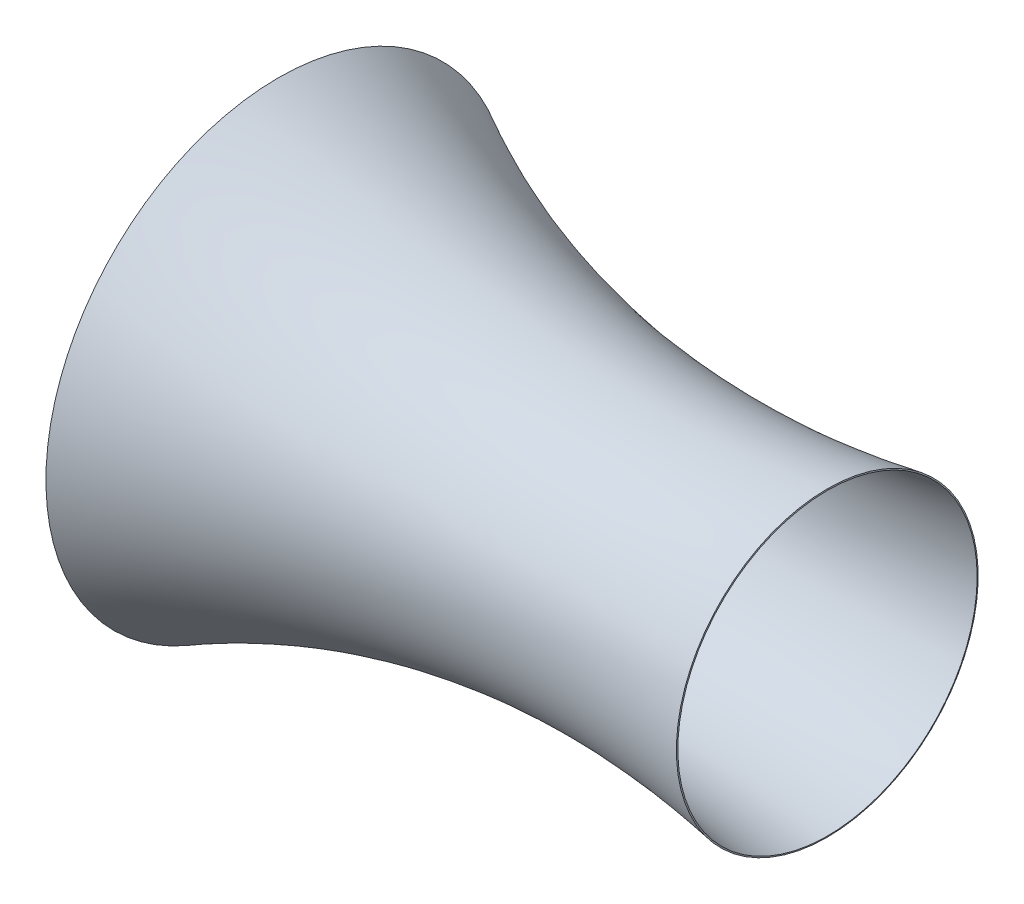
ISO-10303-21;
HEADER;
FILE_DESCRIPTION(('STEP AP214'),'2;1');
FILE_NAME('part.step','',(''),(''),'','','');
FILE_SCHEMA(('AUTOMOTIVE_DESIGN { 1 0 10303 214 1 1 1 1 }'));
ENDSEC;
DATA;
#1=APPLICATION_CONTEXT('core data for automotive mechanical design processes');
#2=APPLICATION_PROTOCOL_DEFINITION('international standard','automotive_design',2000,#1);
#3=PRODUCT_CONTEXT('',#1,'mechanical');
#4=PRODUCT('Part','Part','',(#3));
#5=PRODUCT_RELATED_PRODUCT_CATEGORY('part','',(#4));
#6=PRODUCT_DEFINITION_FORMATION('','',#4);
#7=PRODUCT_DEFINITION_CONTEXT('part definition',#1,'design');
#8=PRODUCT_DEFINITION('design','',#6,#7);
#9=PRODUCT_DEFINITION_SHAPE('','',#8);
#10=(LENGTH_UNIT() NAMED_UNIT(*) SI_UNIT(.MILLI.,.METRE.));
#11=(NAMED_UNIT(*) PLANE_ANGLE_UNIT() SI_UNIT($,.RADIAN.));
#12=(NAMED_UNIT(*) SI_UNIT($,.STERADIAN.) SOLID_ANGLE_UNIT());
#13=UNCERTAINTY_MEASURE_WITH_UNIT(LENGTH_MEASURE(1.E-05),#10,'distance_accuracy_value','');
#14=(GEOMETRIC_REPRESENTATION_CONTEXT(3) GLOBAL_UNCERTAINTY_ASSIGNED_CONTEXT((#13)) GLOBAL_UNIT_ASSIGNED_CONTEXT((#10,
#11,#12)) REPRESENTATION_CONTEXT('',''));
#15=CARTESIAN_POINT('',(0.,0.,0.));
#16=DIRECTION('',(0.,0.,1.));
#17=DIRECTION('',(1.,0.,0.));
#18=AXIS2_PLACEMENT_3D('',#15,#16,#17);
#19=CARTESIAN_POINT('',(58.1645223558109,0.,0.));
#20=DIRECTION('',(-1.,0.,0.));
#21=DIRECTION('',(0.,0.,1.));
#22=AXIS2_PLACEMENT_3D('',#19,#20,#21);
#23=PLANE('',#22);
#24=CARTESIAN_POINT('',(58.1645223558109,0.,0.));
#25=DIRECTION('',(1.,0.,0.));
#26=DIRECTION('',(0.,0.,-1.));
#27=AXIS2_PLACEMENT_3D('',#24,#25,#26);
#28=CIRCLE('',#27,825.);
#29=CARTESIAN_POINT('',(58.1645223558109,0.,-825.));
#30=VERTEX_POINT('',#29);
#31=EDGE_CURVE('E51',#30,#30,#28,.T.);
#32=ORIENTED_EDGE('',*,*,#31,.F.);
#33=EDGE_LOOP('',(#32));
#34=FACE_BOUND('',#33,.T.);
#35=CARTESIAN_POINT('',(58.1645223558109,0.,0.));
#36=DIRECTION('',(1.,0.,0.));
#37=DIRECTION('',(0.,0.,-1.));
#38=AXIS2_PLACEMENT_3D('',#35,#36,#37);
#39=CIRCLE('',#38,830.);
#40=CARTESIAN_POINT('',(58.1645223558109,0.,-830.));
#41=VERTEX_POINT('',#40);
#42=EDGE_CURVE('E114',#41,#41,#39,.T.);
#43=ORIENTED_EDGE('',*,*,#42,.T.);
#44=EDGE_LOOP('',(#43));
#45=FACE_BOUND('',#44,.T.);
#46=ADVANCED_FACE('F33',(#34,#45),#23,.F.);
#47=CARTESIAN_POINT('',(2200.,0.,0.));
#48=DIRECTION('',(-1.,0.,0.));
#49=DIRECTION('',(0.,0.,1.));
#50=AXIS2_PLACEMENT_3D('',#47,#48,#49);
#51=CONICAL_SURFACE('',#50,600.,1.39639197111225);
#52=CARTESIAN_POINT('',(2199.13239220012,0.,0.));
#53=DIRECTION('',(1.,0.,0.));
#54=DIRECTION('',(0.,1.,0.));
#55=AXIS2_PLACEMENT_3D('',#52,#53,#54);
#56=CIRCLE('',#55,604.924150353675);
#57=CARTESIAN_POINT('',(2199.13239220012,604.924150353675,0.));
#58=VERTEX_POINT('',#57);
#59=EDGE_CURVE('E10',#58,#58,#56,.T.);
#60=ORIENTED_EDGE('',*,*,#59,.T.);
#61=EDGE_LOOP('',(#60));
#62=FACE_BOUND('',#61,.T.);
#63=CARTESIAN_POINT('',(2200.,0.,0.));
#64=DIRECTION('',(1.,0.,0.));
#65=DIRECTION('',(0.,0.,-1.));
#66=AXIS2_PLACEMENT_3D('',#63,#64,#65);
#67=CIRCLE('',#66,600.);
#68=CARTESIAN_POINT('',(2200.,0.,-600.));
#69=VERTEX_POINT('',#68);
#70=EDGE_CURVE('E36',#69,#69,#67,.T.);
#71=ORIENTED_EDGE('',*,*,#70,.F.);
#72=EDGE_LOOP('',(#71));
#73=FACE_BOUND('',#72,.T.);
#74=ADVANCED_FACE('F150',(#62,#73),#51,.T.);
#75=CARTESIAN_POINT('',(2200.,600.,0.));
#76=CARTESIAN_POINT('',(1006.75090387225,389.756171392603,0.));
#77=CARTESIAN_POINT('',(-10.0675090387225,930.176751823413,0.));
#78=CARTESIAN_POINT('',(-20.1350180774451,935.52745063956,0.));
#79=B_SPLINE_CURVE_WITH_KNOTS('',2,(#75,#76,#77,#78),.UNSPECIFIED.,.F.,.F.,(3,1,3),(0.,1.,1.01),.UNSPECIFIED.);
#80=CARTESIAN_POINT('',(0.,0.,0.));
#81=DIRECTION('',(1.,0.,0.));
#82=AXIS1_PLACEMENT('',#80,#81);
#83=SURFACE_OF_REVOLUTION('',#79,#82);
#84=OFFSET_SURFACE('',#83,-5.,.F.);
#85=CARTESIAN_POINT('',(-1.79882787438272,0.,0.));
#86=DIRECTION('',(1.,0.,0.));
#87=DIRECTION('',(0.,0.,-1.));
#88=AXIS2_PLACEMENT_3D('',#85,#86,#87);
#89=CIRCLE('',#88,931.44441370144);
#90=CARTESIAN_POINT('',(-1.79882787438272,0.,-931.44441370144));
#91=VERTEX_POINT('',#90);
#92=EDGE_CURVE('E40',#91,#91,#89,.T.);
#93=ORIENTED_EDGE('',*,*,#92,.T.);
#94=EDGE_LOOP('',(#93));
#95=FACE_BOUND('',#94,.T.);
#96=ORIENTED_EDGE('',*,*,#59,.F.);
#97=EDGE_LOOP('',(#96));
#98=FACE_BOUND('',#97,.T.);
#99=ADVANCED_FACE('F70',(#95,#98),#84,.F.);
#100=CARTESIAN_POINT('',(2.45982793360692,928.824518530049,0.));
#101=CARTESIAN_POINT('',(1.22991396680346,926.825285768658,0.));
#102=CARTESIAN_POINT('',(-40.6448771597789,858.757553751386,0.));
#103=CARTESIAN_POINT('',(0.745532448811899,798.922234092078,0.));
#104=CARTESIAN_POINT('',(1.4910648976238,797.844468184157,0.));
#105=B_SPLINE_CURVE_WITH_KNOTS('',2,(#100,#101,#102,#103,#104),.UNSPECIFIED.,.F.,.F.,(3,1,1,3),
(-0.0302599996050806,0.,1.,1.01834259323459),.UNSPECIFIED.);
#106=CARTESIAN_POINT('',(0.,0.,0.));
#107=DIRECTION('',(1.,0.,0.));
#108=AXIS1_PLACEMENT('',#106,#107);
#109=SURFACE_OF_REVOLUTION('',#105,#108);
#110=OFFSET_SURFACE('',#109,-5.,.F.);
#111=CARTESIAN_POINT('',(-2.62099064058559,0.,0.));
#112=DIRECTION('',(1.,0.,0.));
#113=DIRECTION('',(0.,0.,-1.));
#114=AXIS2_PLACEMENT_3D('',#111,#112,#113);
#115=CIRCLE('',#114,795.);
#116=CARTESIAN_POINT('',(-2.62099064058559,0.,-795.));
#117=VERTEX_POINT('',#116);
#118=EDGE_CURVE('E45',#117,#117,#115,.T.);
#119=ORIENTED_EDGE('',*,*,#118,.T.);
#120=EDGE_LOOP('',(#119));
#121=FACE_BOUND('',#120,.T.);
#122=ORIENTED_EDGE('',*,*,#92,.F.);
#123=EDGE_LOOP('',(#122));
#124=FACE_BOUND('',#123,.T.);
#125=ADVANCED_FACE('F71',(#121,#124),#110,.F.);
#126=CARTESIAN_POINT('',(0.,0.,0.));
#127=DIRECTION('',(1.,0.,0.));
#128=DIRECTION('',(0.,0.,-1.));
#129=AXIS2_PLACEMENT_3D('',#126,#127,#128);
#130=CYLINDRICAL_SURFACE('',#129,795.);
#131=CARTESIAN_POINT('',(28.8211041168073,0.,0.));
#132=DIRECTION('',(1.,0.,0.));
#133=DIRECTION('',(0.,0.,-1.));
#134=AXIS2_PLACEMENT_3D('',#131,#132,#133);
#135=CIRCLE('',#134,795.);
#136=CARTESIAN_POINT('',(28.8211041168073,0.,-795.));
#137=VERTEX_POINT('',#136);
#138=EDGE_CURVE('E54',#137,#137,#135,.T.);
#139=ORIENTED_EDGE('',*,*,#138,.T.);
#140=EDGE_LOOP('',(#139));
#141=FACE_BOUND('',#140,.T.);
#142=ORIENTED_EDGE('',*,*,#118,.F.);
#143=EDGE_LOOP('',(#142));
#144=FACE_BOUND('',#143,.T.);
#145=ADVANCED_FACE('F74',(#141,#144),#130,.F.);
#146=CARTESIAN_POINT('',(29.8245244772304,0.,0.));
#147=DIRECTION('',(1.,0.,0.));
#148=DIRECTION('',(0.,0.,-1.));
#149=AXIS2_PLACEMENT_3D('',#146,#147,#148);
#150=CONICAL_SURFACE('',#149,798.687002068317,1.30508097022597);
#151=CARTESIAN_POINT('',(36.9856264726182,0.,0.));
#152=DIRECTION('',(1.,0.,0.));
#153=DIRECTION('',(0.,0.,-1.));
#154=AXIS2_PLACEMENT_3D('',#151,#152,#153);
#155=CIRCLE('',#154,825.);
#156=CARTESIAN_POINT('',(36.9856264726182,0.,-825.));
#157=VERTEX_POINT('',#156);
#158=EDGE_CURVE('E49',#157,#157,#155,.T.);
#159=ORIENTED_EDGE('',*,*,#158,.T.);
#160=EDGE_LOOP('',(#159));
#161=FACE_BOUND('',#160,.T.);
#162=ORIENTED_EDGE('',*,*,#138,.F.);
#163=EDGE_LOOP('',(#162));
#164=FACE_BOUND('',#163,.T.);
#165=ADVANCED_FACE('F80',(#161,#164),#150,.F.);
#166=CARTESIAN_POINT('',(0.,0.,0.));
#167=DIRECTION('',(1.,0.,0.));
#168=DIRECTION('',(0.,0.,-1.));
#169=AXIS2_PLACEMENT_3D('',#166,#167,#168);
#170=CYLINDRICAL_SURFACE('',#169,825.);
#171=ORIENTED_EDGE('',*,*,#31,.T.);
#172=EDGE_LOOP('',(#171));
#173=FACE_BOUND('',#172,.T.);
#174=ORIENTED_EDGE('',*,*,#158,.F.);
#175=EDGE_LOOP('',(#174));
#176=FACE_BOUND('',#175,.T.);
#177=ADVANCED_FACE('F84',(#173,#176),#170,.F.);
#178=CARTESIAN_POINT('',(2200.,600.,0.));
#179=CARTESIAN_POINT('',(1006.75090387225,389.756171392603,0.));
#180=CARTESIAN_POINT('',(0.,924.826053007267,0.));
#181=B_SPLINE_CURVE_WITH_KNOTS('',2,(#178,#179,#180),.UNSPECIFIED.,.F.,.F.,(3,3),(0.,1.),.UNSPECIFIED.);
#182=CARTESIAN_POINT('',(0.,0.,0.));
#183=DIRECTION('',(1.,0.,0.));
#184=AXIS1_PLACEMENT('',#182,#183);
#185=SURFACE_OF_REVOLUTION('',#181,#184);
#186=CARTESIAN_POINT('',(0.,0.,0.));
#187=DIRECTION('',(1.,0.,0.));
#188=DIRECTION('',(0.,0.,-1.));
#189=AXIS2_PLACEMENT_3D('',#186,#187,#188);
#190=CIRCLE('',#189,924.826053007267);
#191=CARTESIAN_POINT('',(0.,0.,-924.826053007267));
#192=VERTEX_POINT('',#191);
#193=EDGE_CURVE('E128',#192,#192,#190,.T.);
#194=ORIENTED_EDGE('',*,*,#193,.F.);
#195=EDGE_LOOP('',(#194));
#196=FACE_BOUND('',#195,.T.);
#197=ORIENTED_EDGE('',*,*,#70,.T.);
#198=EDGE_LOOP('',(#197));
#199=FACE_BOUND('',#198,.T.);
#200=ADVANCED_FACE('F88',(#196,#199),#185,.T.);
#201=CARTESIAN_POINT('',(0.,924.826053007267,0.));
#202=CARTESIAN_POINT('',(-40.6448771597789,858.757553751386,0.));
#203=CARTESIAN_POINT('',(0.,800.,0.));
#204=B_SPLINE_CURVE_WITH_KNOTS('',2,(#201,#202,#203),.UNSPECIFIED.,.F.,.F.,(3,3),(0.,1.),.UNSPECIFIED.);
#205=CARTESIAN_POINT('',(0.,0.,0.));
#206=DIRECTION('',(1.,0.,0.));
#207=AXIS1_PLACEMENT('',#205,#206);
#208=SURFACE_OF_REVOLUTION('',#204,#207);
#209=CARTESIAN_POINT('',(0.,0.,0.));
#210=DIRECTION('',(1.,0.,0.));
#211=DIRECTION('',(0.,0.,-1.));
#212=AXIS2_PLACEMENT_3D('',#209,#210,#211);
#213=CIRCLE('',#212,800.);
#214=CARTESIAN_POINT('',(0.,0.,-800.));
#215=VERTEX_POINT('',#214);
#216=EDGE_CURVE('E126',#215,#215,#213,.T.);
#217=ORIENTED_EDGE('',*,*,#216,.F.);
#218=EDGE_LOOP('',(#217));
#219=FACE_BOUND('',#218,.T.);
#220=ORIENTED_EDGE('',*,*,#193,.T.);
#221=EDGE_LOOP('',(#220));
#222=FACE_BOUND('',#221,.T.);
#223=ADVANCED_FACE('F101',(#219,#222),#208,.T.);
#224=CARTESIAN_POINT('',(0.,0.,0.));
#225=DIRECTION('',(1.,0.,0.));
#226=DIRECTION('',(0.,0.,-1.));
#227=AXIS2_PLACEMENT_3D('',#224,#225,#226);
#228=CYLINDRICAL_SURFACE('',#227,800.);
#229=CARTESIAN_POINT('',(25.,0.,0.));
#230=DIRECTION('',(1.,0.,0.));
#231=DIRECTION('',(0.,0.,-1.));
#232=AXIS2_PLACEMENT_3D('',#229,#230,#231);
#233=CIRCLE('',#232,800.);
#234=CARTESIAN_POINT('',(25.,0.,-800.));
#235=VERTEX_POINT('',#234);
#236=EDGE_CURVE('E120',#235,#235,#233,.T.);
#237=ORIENTED_EDGE('',*,*,#236,.F.);
#238=EDGE_LOOP('',(#237));
#239=FACE_BOUND('',#238,.T.);
#240=ORIENTED_EDGE('',*,*,#216,.T.);
#241=EDGE_LOOP('',(#240));
#242=FACE_BOUND('',#241,.T.);
#243=ADVANCED_FACE('F97',(#239,#242),#228,.T.);
#244=CARTESIAN_POINT('',(25.,0.,0.));
#245=DIRECTION('',(1.,0.,0.));
#246=DIRECTION('',(0.,0.,-1.));
#247=AXIS2_PLACEMENT_3D('',#244,#245,#246);
#248=CONICAL_SURFACE('',#247,800.,1.30508097022597);
#249=CARTESIAN_POINT('',(33.1645223558109,0.,0.));
#250=DIRECTION('',(1.,0.,0.));
#251=DIRECTION('',(0.,0.,-1.));
#252=AXIS2_PLACEMENT_3D('',#249,#250,#251);
#253=CIRCLE('',#252,830.);
#254=CARTESIAN_POINT('',(33.1645223558109,0.,-830.));
#255=VERTEX_POINT('',#254);
#256=EDGE_CURVE('E121',#255,#255,#253,.T.);
#257=ORIENTED_EDGE('',*,*,#256,.F.);
#258=EDGE_LOOP('',(#257));
#259=FACE_BOUND('',#258,.T.);
#260=ORIENTED_EDGE('',*,*,#236,.T.);
#261=EDGE_LOOP('',(#260));
#262=FACE_BOUND('',#261,.T.);
#263=ADVANCED_FACE('F93',(#259,#262),#248,.T.);
#264=CARTESIAN_POINT('',(0.,0.,0.));
#265=DIRECTION('',(1.,0.,0.));
#266=DIRECTION('',(0.,0.,-1.));
#267=AXIS2_PLACEMENT_3D('',#264,#265,#266);
#268=CYLINDRICAL_SURFACE('',#267,830.);
#269=ORIENTED_EDGE('',*,*,#42,.F.);
#270=EDGE_LOOP('',(#269));
#271=FACE_BOUND('',#270,.T.);
#272=ORIENTED_EDGE('',*,*,#256,.T.);
#273=EDGE_LOOP('',(#272));
#274=FACE_BOUND('',#273,.T.);
#275=ADVANCED_FACE('F90',(#271,#274),#268,.T.);
#276=CLOSED_SHELL('',(#46,#74,#99,#125,#145,#165,#177,#200,#223,#243,#263,#275));
#277=MANIFOLD_SOLID_BREP('B2',#276);
#278=ADVANCED_BREP_SHAPE_REPRESENTATION('',(#18,#277),#14);
#279=SHAPE_DEFINITION_REPRESENTATION(#9,#278);
ENDSEC;
END-ISO-10303-21;
